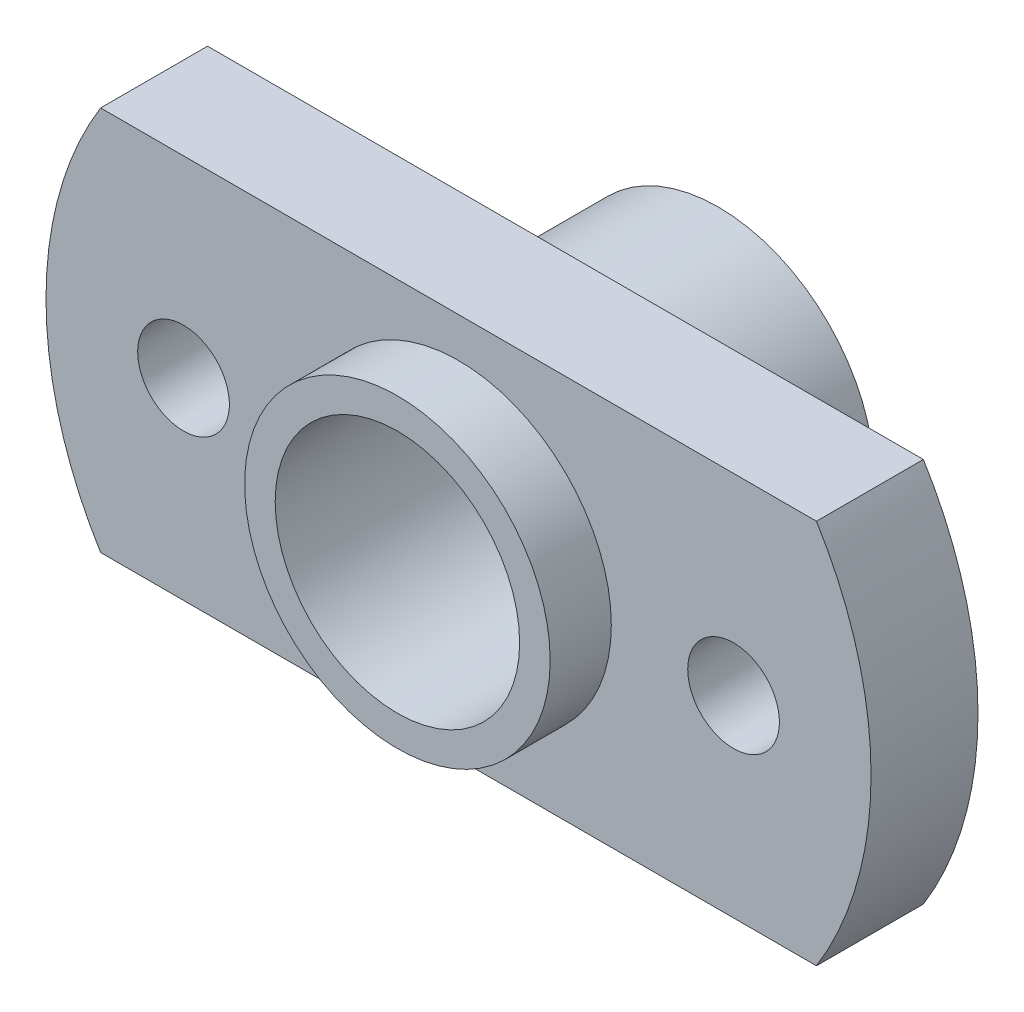
ISO-10303-21;
HEADER;
FILE_DESCRIPTION(('STEP AP214'),'2;1');
FILE_NAME('part.step','',(''),(''),'','','');
FILE_SCHEMA(('AUTOMOTIVE_DESIGN { 1 0 10303 214 1 1 1 1 }'));
ENDSEC;
DATA;
#1=APPLICATION_CONTEXT('core data for automotive mechanical design processes');
#2=APPLICATION_PROTOCOL_DEFINITION('international standard','automotive_design',2000,#1);
#3=PRODUCT_CONTEXT('',#1,'mechanical');
#4=PRODUCT('Part','Part','',(#3));
#5=PRODUCT_RELATED_PRODUCT_CATEGORY('part','',(#4));
#6=PRODUCT_DEFINITION_FORMATION('','',#4);
#7=PRODUCT_DEFINITION_CONTEXT('part definition',#1,'design');
#8=PRODUCT_DEFINITION('design','',#6,#7);
#9=PRODUCT_DEFINITION_SHAPE('','',#8);
#10=(LENGTH_UNIT() NAMED_UNIT(*) SI_UNIT(.MILLI.,.METRE.));
#11=(NAMED_UNIT(*) PLANE_ANGLE_UNIT() SI_UNIT($,.RADIAN.));
#12=(NAMED_UNIT(*) SI_UNIT($,.STERADIAN.) SOLID_ANGLE_UNIT());
#13=UNCERTAINTY_MEASURE_WITH_UNIT(LENGTH_MEASURE(1.E-05),#10,'distance_accuracy_value','');
#14=(GEOMETRIC_REPRESENTATION_CONTEXT(3) GLOBAL_UNCERTAINTY_ASSIGNED_CONTEXT((#13)) GLOBAL_UNIT_ASSIGNED_CONTEXT((#10,
#11,#12)) REPRESENTATION_CONTEXT('',''));
#15=CARTESIAN_POINT('',(0.,0.,0.));
#16=DIRECTION('',(0.,0.,1.));
#17=DIRECTION('',(1.,0.,0.));
#18=AXIS2_PLACEMENT_3D('',#15,#16,#17);
#19=CARTESIAN_POINT('',(-166.1,-80.50005788601,172.0264319846));
#20=DIRECTION('',(0.,0.,1.));
#21=DIRECTION('',(1.,0.,0.));
#22=AXIS2_PLACEMENT_3D('',#19,#20,#21);
#23=PLANE('',#22);
#24=CARTESIAN_POINT('',(-166.1,-80.50005788601,172.0264319846));
#25=DIRECTION('',(0.,0.,-1.));
#26=DIRECTION('',(-1.,0.,0.));
#27=AXIS2_PLACEMENT_3D('',#24,#25,#26);
#28=CIRCLE('',#27,4.);
#29=CARTESIAN_POINT('',(-170.1,-80.50005788601,172.0264319846));
#30=VERTEX_POINT('',#29);
#31=EDGE_CURVE('E112',#30,#30,#28,.F.);
#32=ORIENTED_EDGE('',*,*,#31,.T.);
#33=EDGE_LOOP('',(#32));
#34=FACE_BOUND('',#33,.T.);
#35=CARTESIAN_POINT('',(-166.1,-80.50005788601,172.0264319846));
#36=DIRECTION('',(0.,0.,-1.));
#37=DIRECTION('',(-1.,0.,0.));
#38=AXIS2_PLACEMENT_3D('',#35,#36,#37);
#39=CIRCLE('',#38,5.09999999999999);
#40=CARTESIAN_POINT('',(-171.2,-80.50005788601,172.0264319846));
#41=VERTEX_POINT('',#40);
#42=EDGE_CURVE('E24',#41,#41,#39,.F.);
#43=ORIENTED_EDGE('',*,*,#42,.F.);
#44=EDGE_LOOP('',(#43));
#45=FACE_BOUND('',#44,.T.);
#46=ADVANCED_FACE('F21',(#34,#45),#23,.F.);
#47=CARTESIAN_POINT('',(-166.1,-80.50005788601,182.5264319846));
#48=DIRECTION('',(0.,0.,-1.));
#49=DIRECTION('',(-1.,0.,0.));
#50=AXIS2_PLACEMENT_3D('',#47,#48,#49);
#51=CYLINDRICAL_SURFACE('',#50,5.09999999999999);
#52=ORIENTED_EDGE('',*,*,#42,.T.);
#53=EDGE_LOOP('',(#52));
#54=FACE_BOUND('',#53,.T.);
#55=CARTESIAN_POINT('',(-166.1,-80.50005788601,177.0264319846));
#56=DIRECTION('',(0.,0.,-1.));
#57=DIRECTION('',(-1.,0.,0.));
#58=AXIS2_PLACEMENT_3D('',#55,#56,#57);
#59=CIRCLE('',#58,5.09999999999999);
#60=CARTESIAN_POINT('',(-171.2,-80.50005788601,177.0264319846));
#61=VERTEX_POINT('',#60);
#62=EDGE_CURVE('E107',#61,#61,#59,.T.);
#63=ORIENTED_EDGE('',*,*,#62,.T.);
#64=EDGE_LOOP('',(#63));
#65=FACE_BOUND('',#64,.T.);
#66=ADVANCED_FACE('F123',(#54,#65),#51,.T.);
#67=CARTESIAN_POINT('',(-166.1,-80.50005788601,182.5264319846));
#68=DIRECTION('',(0.,0.,-1.));
#69=DIRECTION('',(-1.,0.,0.));
#70=AXIS2_PLACEMENT_3D('',#67,#68,#69);
#71=CYLINDRICAL_SURFACE('',#70,4.);
#72=CARTESIAN_POINT('',(-166.1,-80.50005788601,182.5264319846));
#73=DIRECTION('',(0.,0.,-1.));
#74=DIRECTION('',(-1.,0.,0.));
#75=AXIS2_PLACEMENT_3D('',#72,#73,#74);
#76=CIRCLE('',#75,4.);
#77=CARTESIAN_POINT('',(-170.1,-80.50005788601,182.5264319846));
#78=VERTEX_POINT('',#77);
#79=EDGE_CURVE('E111',#78,#78,#76,.T.);
#80=ORIENTED_EDGE('',*,*,#79,.F.);
#81=EDGE_LOOP('',(#80));
#82=FACE_BOUND('',#81,.T.);
#83=ORIENTED_EDGE('',*,*,#31,.F.);
#84=EDGE_LOOP('',(#83));
#85=FACE_BOUND('',#84,.T.);
#86=ADVANCED_FACE('F131',(#82,#85),#71,.F.);
#87=CARTESIAN_POINT('',(-166.1,-80.50005788601,177.0264319846));
#88=DIRECTION('',(0.,0.,1.));
#89=DIRECTION('',(1.,0.,0.));
#90=AXIS2_PLACEMENT_3D('',#87,#88,#89);
#91=PLANE('',#90);
#92=ORIENTED_EDGE('',*,*,#62,.F.);
#93=EDGE_LOOP('',(#92));
#94=FACE_BOUND('',#93,.T.);
#95=DIRECTION('',(1.,0.,0.));
#96=VECTOR('',#95,1.);
#97=CARTESIAN_POINT('',(-155.8528172695,-74.20005788601,177.0264319846));
#98=LINE('',#97,#96);
#99=CARTESIAN_POINT('',(-177.813226718326,-74.20005788601,177.0264319846));
#100=VERTEX_POINT('',#99);
#101=CARTESIAN_POINT('',(-154.386773281667,-74.20005788601,177.0264319846));
#102=VERTEX_POINT('',#101);
#103=EDGE_CURVE('E66',#100,#102,#98,.T.);
#104=ORIENTED_EDGE('',*,*,#103,.T.);
#105=CARTESIAN_POINT('',(-164.6,-80.50005788601,177.0264319846));
#106=DIRECTION('',(0.,0.,1.));
#107=DIRECTION('',(1.,0.,0.));
#108=AXIS2_PLACEMENT_3D('',#105,#106,#107);
#109=CIRCLE('',#108,12.);
#110=CARTESIAN_POINT('',(-154.386773281659,-86.8000578859906,177.0264319846));
#111=VERTEX_POINT('',#110);
#112=EDGE_CURVE('E88',#111,#102,#109,.T.);
#113=ORIENTED_EDGE('',*,*,#112,.F.);
#114=DIRECTION('',(1.,0.,0.));
#115=VECTOR('',#114,1.);
#116=CARTESIAN_POINT('',(-177.6681148043,-86.80005788601,177.0264319846));
#117=LINE('',#116,#115);
#118=CARTESIAN_POINT('',(-177.813226718329,-86.80005788601,177.0264319846));
#119=VERTEX_POINT('',#118);
#120=EDGE_CURVE('E69',#111,#119,#117,.F.);
#121=ORIENTED_EDGE('',*,*,#120,.T.);
#122=CARTESIAN_POINT('',(-167.6,-80.50005788601,177.0264319846));
#123=DIRECTION('',(0.,0.,1.));
#124=DIRECTION('',(1.,0.,0.));
#125=AXIS2_PLACEMENT_3D('',#122,#123,#124);
#126=CIRCLE('',#125,12.);
#127=EDGE_CURVE('E61',#100,#119,#126,.T.);
#128=ORIENTED_EDGE('',*,*,#127,.F.);
#129=EDGE_LOOP('',(#104,#113,#121,#128));
#130=FACE_BOUND('',#129,.T.);
#131=CARTESIAN_POINT('',(-175.1,-80.50005788601,177.0264319846));
#132=DIRECTION('',(0.,0.,-1.));
#133=DIRECTION('',(-1.,0.,0.));
#134=AXIS2_PLACEMENT_3D('',#131,#132,#133);
#135=CIRCLE('',#134,1.5);
#136=CARTESIAN_POINT('',(-176.6,-80.50005788601,177.0264319846));
#137=VERTEX_POINT('',#136);
#138=EDGE_CURVE('E73',#137,#137,#135,.F.);
#139=ORIENTED_EDGE('',*,*,#138,.T.);
#140=EDGE_LOOP('',(#139));
#141=FACE_BOUND('',#140,.T.);
#142=CARTESIAN_POINT('',(-157.1,-80.50005788601,177.0264319846));
#143=DIRECTION('',(0.,0.,-1.));
#144=DIRECTION('',(-1.,0.,0.));
#145=AXIS2_PLACEMENT_3D('',#142,#143,#144);
#146=CIRCLE('',#145,1.5);
#147=CARTESIAN_POINT('',(-158.6,-80.50005788601,177.0264319846));
#148=VERTEX_POINT('',#147);
#149=EDGE_CURVE('E178',#148,#148,#146,.F.);
#150=ORIENTED_EDGE('',*,*,#149,.T.);
#151=EDGE_LOOP('',(#150));
#152=FACE_BOUND('',#151,.T.);
#153=ADVANCED_FACE('F63',(#94,#130,#141,#152),#91,.F.);
#154=CARTESIAN_POINT('',(533.2347338397,-344.6602275476,182.5264319846));
#155=DIRECTION('',(0.,0.,1.));
#156=DIRECTION('',(1.,0.,0.));
#157=AXIS2_PLACEMENT_3D('',#154,#155,#156);
#158=PLANE('',#157);
#159=ORIENTED_EDGE('',*,*,#79,.T.);
#160=EDGE_LOOP('',(#159));
#161=FACE_BOUND('',#160,.T.);
#162=CARTESIAN_POINT('',(-166.1,-80.50005788601,182.5264319846));
#163=DIRECTION('',(0.,0.,1.));
#164=DIRECTION('',(1.,0.,0.));
#165=AXIS2_PLACEMENT_3D('',#162,#163,#164);
#166=CIRCLE('',#165,5.);
#167=CARTESIAN_POINT('',(-161.1,-80.50005788601,182.5264319846));
#168=VERTEX_POINT('',#167);
#169=EDGE_CURVE('E83',#168,#168,#166,.F.);
#170=ORIENTED_EDGE('',*,*,#169,.F.);
#171=EDGE_LOOP('',(#170));
#172=FACE_BOUND('',#171,.T.);
#173=ADVANCED_FACE('F162',(#161,#172),#158,.T.);
#174=CARTESIAN_POINT('',(-157.1,-80.50005788601,180.5264319846));
#175=DIRECTION('',(0.,0.,-1.));
#176=DIRECTION('',(-1.,0.,0.));
#177=AXIS2_PLACEMENT_3D('',#174,#175,#176);
#178=CYLINDRICAL_SURFACE('',#177,1.5);
#179=ORIENTED_EDGE('',*,*,#149,.F.);
#180=EDGE_LOOP('',(#179));
#181=FACE_BOUND('',#180,.T.);
#182=CARTESIAN_POINT('',(-157.1,-80.50005788601,180.5264319846));
#183=DIRECTION('',(0.,0.,-1.));
#184=DIRECTION('',(-1.,0.,0.));
#185=AXIS2_PLACEMENT_3D('',#182,#183,#184);
#186=CIRCLE('',#185,1.5);
#187=CARTESIAN_POINT('',(-158.6,-80.50005788601,180.5264319846));
#188=VERTEX_POINT('',#187);
#189=EDGE_CURVE('E190',#188,#188,#186,.T.);
#190=ORIENTED_EDGE('',*,*,#189,.F.);
#191=EDGE_LOOP('',(#190));
#192=FACE_BOUND('',#191,.T.);
#193=ADVANCED_FACE('F158',(#181,#192),#178,.F.);
#194=CARTESIAN_POINT('',(-175.1,-80.50005788601,180.5264319846));
#195=DIRECTION('',(0.,0.,-1.));
#196=DIRECTION('',(-1.,0.,0.));
#197=AXIS2_PLACEMENT_3D('',#194,#195,#196);
#198=CYLINDRICAL_SURFACE('',#197,1.5);
#199=ORIENTED_EDGE('',*,*,#138,.F.);
#200=EDGE_LOOP('',(#199));
#201=FACE_BOUND('',#200,.T.);
#202=CARTESIAN_POINT('',(-175.1,-80.50005788601,180.5264319846));
#203=DIRECTION('',(0.,0.,-1.));
#204=DIRECTION('',(-1.,0.,0.));
#205=AXIS2_PLACEMENT_3D('',#202,#203,#204);
#206=CIRCLE('',#205,1.5);
#207=CARTESIAN_POINT('',(-176.6,-80.50005788601,180.5264319846));
#208=VERTEX_POINT('',#207);
#209=EDGE_CURVE('E195',#208,#208,#206,.T.);
#210=ORIENTED_EDGE('',*,*,#209,.F.);
#211=EDGE_LOOP('',(#210));
#212=FACE_BOUND('',#211,.T.);
#213=ADVANCED_FACE('F155',(#201,#212),#198,.F.);
#214=CARTESIAN_POINT('',(-167.6,-80.50005788601,180.5264319846));
#215=DIRECTION('',(0.,0.,1.));
#216=DIRECTION('',(1.,0.,0.));
#217=AXIS2_PLACEMENT_3D('',#214,#215,#216);
#218=CYLINDRICAL_SURFACE('',#217,12.);
#219=DIRECTION('',(0.,0.,-1.));
#220=VECTOR('',#219,1.);
#221=CARTESIAN_POINT('',(-177.813226718323,-74.20005788601,177.0264319846));
#222=LINE('',#221,#220);
#223=CARTESIAN_POINT('',(-177.813226718328,-74.200057886013,180.5264319846));
#224=VERTEX_POINT('',#223);
#225=EDGE_CURVE('E76',#224,#100,#222,.T.);
#226=ORIENTED_EDGE('',*,*,#225,.T.);
#227=ORIENTED_EDGE('',*,*,#127,.T.);
#228=DIRECTION('',(0.,0.,1.));
#229=VECTOR('',#228,1.);
#230=CARTESIAN_POINT('',(-177.813226718329,-86.80005788601,177.0264319846));
#231=LINE('',#230,#229);
#232=CARTESIAN_POINT('',(-177.813226718329,-86.80005788601,180.5264319846));
#233=VERTEX_POINT('',#232);
#234=EDGE_CURVE('E99',#119,#233,#231,.T.);
#235=ORIENTED_EDGE('',*,*,#234,.T.);
#236=CARTESIAN_POINT('',(-167.6,-80.50005788601,180.5264319846));
#237=DIRECTION('',(0.,0.,1.));
#238=DIRECTION('',(1.,0.,0.));
#239=AXIS2_PLACEMENT_3D('',#236,#237,#238);
#240=CIRCLE('',#239,12.);
#241=EDGE_CURVE('E79',#224,#233,#240,.T.);
#242=ORIENTED_EDGE('',*,*,#241,.F.);
#243=EDGE_LOOP('',(#226,#227,#235,#242));
#244=FACE_BOUND('',#243,.T.);
#245=ADVANCED_FACE('F77',(#244),#218,.T.);
#246=CARTESIAN_POINT('',(-177.6681148043,-86.80005788601,177.0264319846));
#247=DIRECTION('',(0.,1.,0.));
#248=DIRECTION('',(0.,0.,1.));
#249=AXIS2_PLACEMENT_3D('',#246,#247,#248);
#250=PLANE('',#249);
#251=ORIENTED_EDGE('',*,*,#120,.F.);
#252=DIRECTION('',(0.,0.,1.));
#253=VECTOR('',#252,1.);
#254=CARTESIAN_POINT('',(-154.386773281647,-86.8000578859713,180.5264319846));
#255=LINE('',#254,#253);
#256=CARTESIAN_POINT('',(-154.386773281659,-86.8000578859906,180.5264319846));
#257=VERTEX_POINT('',#256);
#258=EDGE_CURVE('E94',#257,#111,#255,.F.);
#259=ORIENTED_EDGE('',*,*,#258,.F.);
#260=DIRECTION('',(1.,0.,0.));
#261=VECTOR('',#260,1.);
#262=CARTESIAN_POINT('',(-166.1,-86.80005788601,180.5264319846));
#263=LINE('',#262,#261);
#264=EDGE_CURVE('E202',#233,#257,#263,.T.);
#265=ORIENTED_EDGE('',*,*,#264,.F.);
#266=ORIENTED_EDGE('',*,*,#234,.F.);
#267=EDGE_LOOP('',(#251,#259,#265,#266));
#268=FACE_BOUND('',#267,.T.);
#269=ADVANCED_FACE('F148',(#268),#250,.F.);
#270=CARTESIAN_POINT('',(-164.6,-80.50005788601,180.5264319846));
#271=DIRECTION('',(0.,0.,1.));
#272=DIRECTION('',(1.,0.,0.));
#273=AXIS2_PLACEMENT_3D('',#270,#271,#272);
#274=CYLINDRICAL_SURFACE('',#273,12.);
#275=DIRECTION('',(0.,0.,-1.));
#276=VECTOR('',#275,1.);
#277=CARTESIAN_POINT('',(-154.386773281663,-74.20005788601,177.0264319846));
#278=LINE('',#277,#276);
#279=CARTESIAN_POINT('',(-154.386773281665,-74.200057886013,180.5264319846));
#280=VERTEX_POINT('',#279);
#281=EDGE_CURVE('E84',#102,#280,#278,.F.);
#282=ORIENTED_EDGE('',*,*,#281,.T.);
#283=CARTESIAN_POINT('',(-164.6,-80.50005788601,180.5264319846));
#284=DIRECTION('',(0.,0.,1.));
#285=DIRECTION('',(1.,0.,0.));
#286=AXIS2_PLACEMENT_3D('',#283,#284,#285);
#287=CIRCLE('',#286,12.);
#288=EDGE_CURVE('E40',#257,#280,#287,.T.);
#289=ORIENTED_EDGE('',*,*,#288,.F.);
#290=ORIENTED_EDGE('',*,*,#258,.T.);
#291=ORIENTED_EDGE('',*,*,#112,.T.);
#292=EDGE_LOOP('',(#282,#289,#290,#291));
#293=FACE_BOUND('',#292,.T.);
#294=ADVANCED_FACE('F145',(#293),#274,.T.);
#295=CARTESIAN_POINT('',(-155.8528172695,-74.20005788601,177.0264319846));
#296=DIRECTION('',(0.,-1.,0.));
#297=DIRECTION('',(0.,0.,-1.));
#298=AXIS2_PLACEMENT_3D('',#295,#296,#297);
#299=PLANE('',#298);
#300=DIRECTION('',(1.,0.,0.));
#301=VECTOR('',#300,1.);
#302=CARTESIAN_POINT('',(-166.1,-74.200057886016,180.5264319846));
#303=LINE('',#302,#301);
#304=EDGE_CURVE('E31',#280,#224,#303,.F.);
#305=ORIENTED_EDGE('',*,*,#304,.F.);
#306=ORIENTED_EDGE('',*,*,#281,.F.);
#307=ORIENTED_EDGE('',*,*,#103,.F.);
#308=ORIENTED_EDGE('',*,*,#225,.F.);
#309=EDGE_LOOP('',(#305,#306,#307,#308));
#310=FACE_BOUND('',#309,.T.);
#311=ADVANCED_FACE('F86',(#310),#299,.F.);
#312=CARTESIAN_POINT('',(-166.1,-80.50005788601,180.5264319846));
#313=DIRECTION('',(0.,0.,1.));
#314=DIRECTION('',(1.,0.,0.));
#315=AXIS2_PLACEMENT_3D('',#312,#313,#314);
#316=CYLINDRICAL_SURFACE('',#315,5.);
#317=ORIENTED_EDGE('',*,*,#169,.T.);
#318=EDGE_LOOP('',(#317));
#319=FACE_BOUND('',#318,.T.);
#320=CARTESIAN_POINT('',(-166.1,-80.50005788601,180.5264319846));
#321=DIRECTION('',(0.,0.,1.));
#322=DIRECTION('',(1.,0.,0.));
#323=AXIS2_PLACEMENT_3D('',#320,#321,#322);
#324=CIRCLE('',#323,5.);
#325=CARTESIAN_POINT('',(-161.1,-80.50005788601,180.5264319846));
#326=VERTEX_POINT('',#325);
#327=EDGE_CURVE('E12',#326,#326,#324,.F.);
#328=ORIENTED_EDGE('',*,*,#327,.F.);
#329=EDGE_LOOP('',(#328));
#330=FACE_BOUND('',#329,.T.);
#331=ADVANCED_FACE('F134',(#319,#330),#316,.T.);
#332=CARTESIAN_POINT('',(-166.1,-80.50005788601,180.5264319846));
#333=DIRECTION('',(0.,0.,1.));
#334=DIRECTION('',(1.,0.,0.));
#335=AXIS2_PLACEMENT_3D('',#332,#333,#334);
#336=PLANE('',#335);
#337=ORIENTED_EDGE('',*,*,#327,.T.);
#338=EDGE_LOOP('',(#337));
#339=FACE_BOUND('',#338,.T.);
#340=ORIENTED_EDGE('',*,*,#288,.T.);
#341=ORIENTED_EDGE('',*,*,#304,.T.);
#342=ORIENTED_EDGE('',*,*,#241,.T.);
#343=ORIENTED_EDGE('',*,*,#264,.T.);
#344=EDGE_LOOP('',(#340,#341,#342,#343));
#345=FACE_BOUND('',#344,.T.);
#346=ORIENTED_EDGE('',*,*,#209,.T.);
#347=EDGE_LOOP('',(#346));
#348=FACE_BOUND('',#347,.T.);
#349=ORIENTED_EDGE('',*,*,#189,.T.);
#350=EDGE_LOOP('',(#349));
#351=FACE_BOUND('',#350,.T.);
#352=ADVANCED_FACE('F132',(#339,#345,#348,#351),#336,.T.);
#353=CLOSED_SHELL('',(#46,#66,#86,#153,#173,#193,#213,#245,#269,#294,#311,#331,#352));
#354=MANIFOLD_SOLID_BREP('B1',#353);
#355=ADVANCED_BREP_SHAPE_REPRESENTATION('',(#18,#354),#14);
#356=SHAPE_DEFINITION_REPRESENTATION(#9,#355);
ENDSEC;
END-ISO-10303-21;
